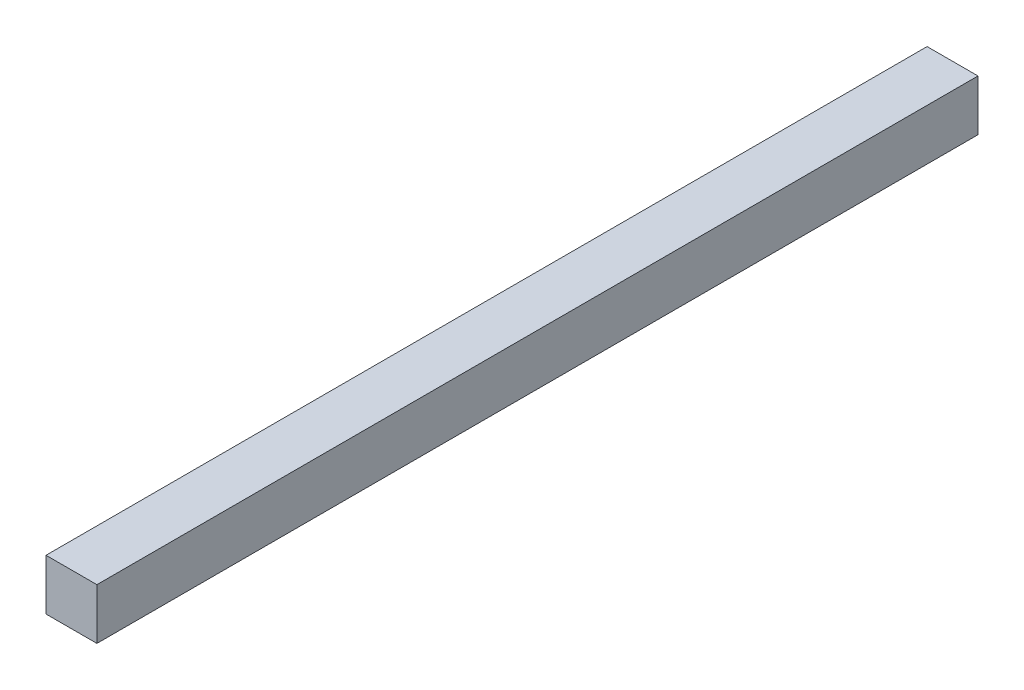
ISO-10303-21;
HEADER;
FILE_DESCRIPTION(('STEP AP214'),'2;1');
FILE_NAME('part.step','',(''),(''),'','','');
FILE_SCHEMA(('AUTOMOTIVE_DESIGN { 1 0 10303 214 1 1 1 1 }'));
ENDSEC;
DATA;
#1=APPLICATION_CONTEXT('core data for automotive mechanical design processes');
#2=APPLICATION_PROTOCOL_DEFINITION('international standard','automotive_design',2000,#1);
#3=PRODUCT_CONTEXT('',#1,'mechanical');
#4=PRODUCT('Part','Part','',(#3));
#5=PRODUCT_RELATED_PRODUCT_CATEGORY('part','',(#4));
#6=PRODUCT_DEFINITION_FORMATION('','',#4);
#7=PRODUCT_DEFINITION_CONTEXT('part definition',#1,'design');
#8=PRODUCT_DEFINITION('design','',#6,#7);
#9=PRODUCT_DEFINITION_SHAPE('','',#8);
#10=(LENGTH_UNIT() NAMED_UNIT(*) SI_UNIT(.MILLI.,.METRE.));
#11=(NAMED_UNIT(*) PLANE_ANGLE_UNIT() SI_UNIT($,.RADIAN.));
#12=(NAMED_UNIT(*) SI_UNIT($,.STERADIAN.) SOLID_ANGLE_UNIT());
#13=UNCERTAINTY_MEASURE_WITH_UNIT(LENGTH_MEASURE(1.E-05),#10,'distance_accuracy_value','');
#14=(GEOMETRIC_REPRESENTATION_CONTEXT(3) GLOBAL_UNCERTAINTY_ASSIGNED_CONTEXT((#13)) GLOBAL_UNIT_ASSIGNED_CONTEXT((#10,
#11,#12)) REPRESENTATION_CONTEXT('',''));
#15=CARTESIAN_POINT('',(0.,0.,0.));
#16=DIRECTION('',(0.,0.,1.));
#17=DIRECTION('',(1.,0.,0.));
#18=AXIS2_PLACEMENT_3D('',#15,#16,#17);
#19=CARTESIAN_POINT('',(3.81,12.25,-8.25));
#20=DIRECTION('',(0.,0.,-1.));
#21=DIRECTION('',(0.,-1.,0.));
#22=AXIS2_PLACEMENT_3D('',#19,#20,#21);
#23=PLANE('',#22);
#24=DIRECTION('',(-1.,0.,0.));
#25=VECTOR('',#24,1.);
#26=CARTESIAN_POINT('',(4.135,11.925,-8.25));
#27=LINE('',#26,#25);
#28=CARTESIAN_POINT('',(4.135,11.925,-8.25));
#29=VERTEX_POINT('',#28);
#30=CARTESIAN_POINT('',(3.485,11.925,-8.25));
#31=VERTEX_POINT('',#30);
#32=EDGE_CURVE('E11',#29,#31,#27,.T.);
#33=ORIENTED_EDGE('',*,*,#32,.T.);
#34=DIRECTION('',(0.,1.,0.));
#35=VECTOR('',#34,1.);
#36=CARTESIAN_POINT('',(3.485,11.925,-8.25));
#37=LINE('',#36,#35);
#38=CARTESIAN_POINT('',(3.485,12.575,-8.25));
#39=VERTEX_POINT('',#38);
#40=EDGE_CURVE('E19',#31,#39,#37,.T.);
#41=ORIENTED_EDGE('',*,*,#40,.T.);
#42=DIRECTION('',(1.,0.,0.));
#43=VECTOR('',#42,1.);
#44=CARTESIAN_POINT('',(3.485,12.575,-8.25));
#45=LINE('',#44,#43);
#46=CARTESIAN_POINT('',(4.135,12.575,-8.25));
#47=VERTEX_POINT('',#46);
#48=EDGE_CURVE('E118',#39,#47,#45,.T.);
#49=ORIENTED_EDGE('',*,*,#48,.T.);
#50=DIRECTION('',(0.,-1.,0.));
#51=VECTOR('',#50,1.);
#52=CARTESIAN_POINT('',(4.135,12.575,-8.25));
#53=LINE('',#52,#51);
#54=EDGE_CURVE('E54',#47,#29,#53,.T.);
#55=ORIENTED_EDGE('',*,*,#54,.T.);
#56=EDGE_LOOP('',(#33,#41,#49,#55));
#57=FACE_BOUND('',#56,.T.);
#58=ADVANCED_FACE('F16',(#57),#23,.T.);
#59=CARTESIAN_POINT('',(3.485,12.575,1.));
#60=DIRECTION('',(-1.,0.,0.));
#61=DIRECTION('',(0.,0.,1.));
#62=AXIS2_PLACEMENT_3D('',#59,#60,#61);
#63=PLANE('',#62);
#64=DIRECTION('',(0.,0.,-1.));
#65=VECTOR('',#64,1.);
#66=CARTESIAN_POINT('',(3.485,11.925,1.));
#67=LINE('',#66,#65);
#68=CARTESIAN_POINT('',(3.485,11.925,3.));
#69=VERTEX_POINT('',#68);
#70=EDGE_CURVE('E97',#69,#31,#67,.T.);
#71=ORIENTED_EDGE('',*,*,#70,.F.);
#72=DIRECTION('',(0.,-1.,0.));
#73=VECTOR('',#72,1.);
#74=CARTESIAN_POINT('',(3.485,11.925,3.));
#75=LINE('',#74,#73);
#76=CARTESIAN_POINT('',(3.485,12.575,3.));
#77=VERTEX_POINT('',#76);
#78=EDGE_CURVE('E70',#77,#69,#75,.T.);
#79=ORIENTED_EDGE('',*,*,#78,.F.);
#80=DIRECTION('',(0.,0.,1.));
#81=VECTOR('',#80,1.);
#82=CARTESIAN_POINT('',(3.485,12.575,1.));
#83=LINE('',#82,#81);
#84=EDGE_CURVE('E110',#39,#77,#83,.T.);
#85=ORIENTED_EDGE('',*,*,#84,.F.);
#86=ORIENTED_EDGE('',*,*,#40,.F.);
#87=EDGE_LOOP('',(#71,#79,#85,#86));
#88=FACE_BOUND('',#87,.T.);
#89=ADVANCED_FACE('F158',(#88),#63,.T.);
#90=CARTESIAN_POINT('',(4.135,12.575,1.));
#91=DIRECTION('',(0.,1.,0.));
#92=DIRECTION('',(1.,0.,0.));
#93=AXIS2_PLACEMENT_3D('',#90,#91,#92);
#94=PLANE('',#93);
#95=ORIENTED_EDGE('',*,*,#84,.T.);
#96=DIRECTION('',(-1.,0.,0.));
#97=VECTOR('',#96,1.);
#98=CARTESIAN_POINT('',(3.485,12.575,3.));
#99=LINE('',#98,#97);
#100=CARTESIAN_POINT('',(4.135,12.575,3.));
#101=VERTEX_POINT('',#100);
#102=EDGE_CURVE('E78',#101,#77,#99,.T.);
#103=ORIENTED_EDGE('',*,*,#102,.F.);
#104=DIRECTION('',(0.,0.,1.));
#105=VECTOR('',#104,1.);
#106=CARTESIAN_POINT('',(4.135,12.575,1.));
#107=LINE('',#106,#105);
#108=EDGE_CURVE('E86',#47,#101,#107,.T.);
#109=ORIENTED_EDGE('',*,*,#108,.F.);
#110=ORIENTED_EDGE('',*,*,#48,.F.);
#111=EDGE_LOOP('',(#95,#103,#109,#110));
#112=FACE_BOUND('',#111,.T.);
#113=ADVANCED_FACE('F163',(#112),#94,.T.);
#114=CARTESIAN_POINT('',(4.135,11.925,1.));
#115=DIRECTION('',(1.,0.,0.));
#116=DIRECTION('',(0.,1.,0.));
#117=AXIS2_PLACEMENT_3D('',#114,#115,#116);
#118=PLANE('',#117);
#119=ORIENTED_EDGE('',*,*,#108,.T.);
#120=DIRECTION('',(0.,1.,0.));
#121=VECTOR('',#120,1.);
#122=CARTESIAN_POINT('',(4.135,12.575,3.));
#123=LINE('',#122,#121);
#124=CARTESIAN_POINT('',(4.135,11.925,3.));
#125=VERTEX_POINT('',#124);
#126=EDGE_CURVE('E82',#125,#101,#123,.T.);
#127=ORIENTED_EDGE('',*,*,#126,.F.);
#128=DIRECTION('',(0.,0.,1.));
#129=VECTOR('',#128,1.);
#130=CARTESIAN_POINT('',(4.135,11.925,1.));
#131=LINE('',#130,#129);
#132=EDGE_CURVE('E85',#29,#125,#131,.T.);
#133=ORIENTED_EDGE('',*,*,#132,.F.);
#134=ORIENTED_EDGE('',*,*,#54,.F.);
#135=EDGE_LOOP('',(#119,#127,#133,#134));
#136=FACE_BOUND('',#135,.T.);
#137=ADVANCED_FACE('F84',(#136),#118,.T.);
#138=CARTESIAN_POINT('',(3.485,11.925,1.));
#139=DIRECTION('',(0.,-1.,0.));
#140=DIRECTION('',(0.,0.,-1.));
#141=AXIS2_PLACEMENT_3D('',#138,#139,#140);
#142=PLANE('',#141);
#143=ORIENTED_EDGE('',*,*,#132,.T.);
#144=DIRECTION('',(1.,0.,0.));
#145=VECTOR('',#144,1.);
#146=CARTESIAN_POINT('',(4.135,11.925,3.));
#147=LINE('',#146,#145);
#148=EDGE_CURVE('E90',#69,#125,#147,.T.);
#149=ORIENTED_EDGE('',*,*,#148,.F.);
#150=ORIENTED_EDGE('',*,*,#70,.T.);
#151=ORIENTED_EDGE('',*,*,#32,.F.);
#152=EDGE_LOOP('',(#143,#149,#150,#151));
#153=FACE_BOUND('',#152,.T.);
#154=ADVANCED_FACE('F94',(#153),#142,.T.);
#155=CARTESIAN_POINT('',(3.81,12.25,3.));
#156=DIRECTION('',(0.,0.,1.));
#157=DIRECTION('',(1.,0.,0.));
#158=AXIS2_PLACEMENT_3D('',#155,#156,#157);
#159=PLANE('',#158);
#160=ORIENTED_EDGE('',*,*,#148,.T.);
#161=ORIENTED_EDGE('',*,*,#126,.T.);
#162=ORIENTED_EDGE('',*,*,#102,.T.);
#163=ORIENTED_EDGE('',*,*,#78,.T.);
#164=EDGE_LOOP('',(#160,#161,#162,#163));
#165=FACE_BOUND('',#164,.T.);
#166=ADVANCED_FACE('F98',(#165),#159,.T.);
#167=CLOSED_SHELL('',(#58,#89,#113,#137,#154,#166));
#168=MANIFOLD_SOLID_BREP('B1',#167);
#169=ADVANCED_BREP_SHAPE_REPRESENTATION('',(#18,#168),#14);
#170=SHAPE_DEFINITION_REPRESENTATION(#9,#169);
ENDSEC;
END-ISO-10303-21;
